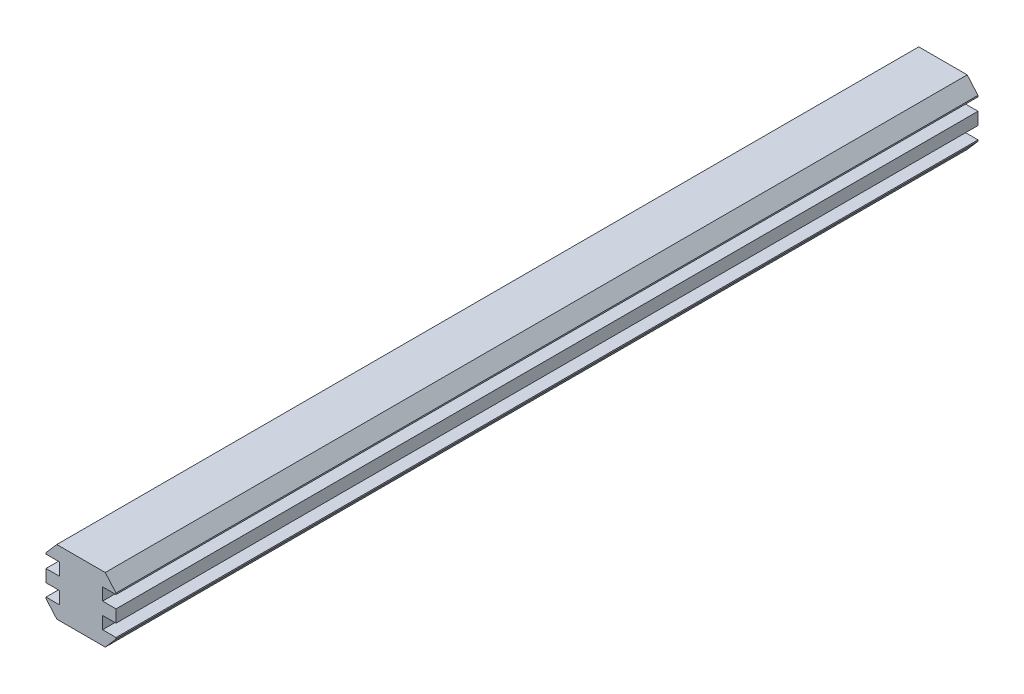
ISO-10303-21;
HEADER;
FILE_DESCRIPTION(('STEP AP214'),'2;1');
FILE_NAME('part.step','',(''),(''),'','','');
FILE_SCHEMA(('AUTOMOTIVE_DESIGN { 1 0 10303 214 1 1 1 1 }'));
ENDSEC;
DATA;
#1=APPLICATION_CONTEXT('core data for automotive mechanical design processes');
#2=APPLICATION_PROTOCOL_DEFINITION('international standard','automotive_design',2000,#1);
#3=PRODUCT_CONTEXT('',#1,'mechanical');
#4=PRODUCT('Part','Part','',(#3));
#5=PRODUCT_RELATED_PRODUCT_CATEGORY('part','',(#4));
#6=PRODUCT_DEFINITION_FORMATION('','',#4);
#7=PRODUCT_DEFINITION_CONTEXT('part definition',#1,'design');
#8=PRODUCT_DEFINITION('design','',#6,#7);
#9=PRODUCT_DEFINITION_SHAPE('','',#8);
#10=(LENGTH_UNIT() NAMED_UNIT(*) SI_UNIT(.MILLI.,.METRE.));
#11=(NAMED_UNIT(*) PLANE_ANGLE_UNIT() SI_UNIT($,.RADIAN.));
#12=(NAMED_UNIT(*) SI_UNIT($,.STERADIAN.) SOLID_ANGLE_UNIT());
#13=UNCERTAINTY_MEASURE_WITH_UNIT(LENGTH_MEASURE(1.E-05),#10,'distance_accuracy_value','');
#14=(GEOMETRIC_REPRESENTATION_CONTEXT(3) GLOBAL_UNCERTAINTY_ASSIGNED_CONTEXT((#13)) GLOBAL_UNIT_ASSIGNED_CONTEXT((#10,
#11,#12)) REPRESENTATION_CONTEXT('',''));
#15=CARTESIAN_POINT('',(0.,0.,0.));
#16=DIRECTION('',(0.,0.,1.));
#17=DIRECTION('',(1.,0.,0.));
#18=AXIS2_PLACEMENT_3D('',#15,#16,#17);
#19=CARTESIAN_POINT('',(4.,3.45,160.));
#20=DIRECTION('',(-1.,0.,0.));
#21=DIRECTION('',(0.,-1.,0.));
#22=AXIS2_PLACEMENT_3D('',#19,#20,#21);
#23=PLANE('',#22);
#24=DIRECTION('',(0.,1.,0.));
#25=VECTOR('',#24,1.);
#26=CARTESIAN_POINT('',(4.,3.45,0.));
#27=LINE('',#26,#25);
#28=CARTESIAN_POINT('',(4.,1.15,0.));
#29=VERTEX_POINT('',#28);
#30=CARTESIAN_POINT('',(4.,3.45,0.));
#31=VERTEX_POINT('',#30);
#32=EDGE_CURVE('E225',#29,#31,#27,.T.);
#33=ORIENTED_EDGE('',*,*,#32,.T.);
#34=DIRECTION('',(0.,0.,-1.));
#35=VECTOR('',#34,1.);
#36=CARTESIAN_POINT('',(4.,3.45,160.));
#37=LINE('',#36,#35);
#38=CARTESIAN_POINT('',(4.,3.45,160.));
#39=VERTEX_POINT('',#38);
#40=EDGE_CURVE('E11',#39,#31,#37,.T.);
#41=ORIENTED_EDGE('',*,*,#40,.F.);
#42=DIRECTION('',(0.,1.,0.));
#43=VECTOR('',#42,1.);
#44=CARTESIAN_POINT('',(4.,3.45,160.));
#45=LINE('',#44,#43);
#46=CARTESIAN_POINT('',(4.,1.15,160.));
#47=VERTEX_POINT('',#46);
#48=EDGE_CURVE('E271',#47,#39,#45,.T.);
#49=ORIENTED_EDGE('',*,*,#48,.F.);
#50=DIRECTION('',(0.,0.,-1.));
#51=VECTOR('',#50,1.);
#52=CARTESIAN_POINT('',(4.,1.15,160.));
#53=LINE('',#52,#51);
#54=EDGE_CURVE('E221',#47,#29,#53,.T.);
#55=ORIENTED_EDGE('',*,*,#54,.T.);
#56=EDGE_LOOP('',(#33,#41,#49,#55));
#57=FACE_BOUND('',#56,.T.);
#58=ADVANCED_FACE('F33',(#57),#23,.F.);
#59=CARTESIAN_POINT('',(6.5,3.45,160.));
#60=DIRECTION('',(0.,1.,0.));
#61=DIRECTION('',(-1.,0.,0.));
#62=AXIS2_PLACEMENT_3D('',#59,#60,#61);
#63=PLANE('',#62);
#64=DIRECTION('',(1.,0.,0.));
#65=VECTOR('',#64,1.);
#66=CARTESIAN_POINT('',(6.5,3.45,0.));
#67=LINE('',#66,#65);
#68=CARTESIAN_POINT('',(6.5,3.45,0.));
#69=VERTEX_POINT('',#68);
#70=EDGE_CURVE('E228',#31,#69,#67,.T.);
#71=ORIENTED_EDGE('',*,*,#70,.T.);
#72=DIRECTION('',(0.,0.,-1.));
#73=VECTOR('',#72,1.);
#74=CARTESIAN_POINT('',(6.5,3.45,160.));
#75=LINE('',#74,#73);
#76=CARTESIAN_POINT('',(6.5,3.45,160.));
#77=VERTEX_POINT('',#76);
#78=EDGE_CURVE('E41',#77,#69,#75,.T.);
#79=ORIENTED_EDGE('',*,*,#78,.F.);
#80=DIRECTION('',(1.,0.,0.));
#81=VECTOR('',#80,1.);
#82=CARTESIAN_POINT('',(6.5,3.45,160.));
#83=LINE('',#82,#81);
#84=EDGE_CURVE('E140',#39,#77,#83,.T.);
#85=ORIENTED_EDGE('',*,*,#84,.F.);
#86=ORIENTED_EDGE('',*,*,#40,.T.);
#87=EDGE_LOOP('',(#71,#79,#85,#86));
#88=FACE_BOUND('',#87,.T.);
#89=ADVANCED_FACE('F409',(#88),#63,.F.);
#90=CARTESIAN_POINT('',(6.5,3.7,160.));
#91=DIRECTION('',(-1.,0.,0.));
#92=DIRECTION('',(0.,-1.,0.));
#93=AXIS2_PLACEMENT_3D('',#90,#91,#92);
#94=PLANE('',#93);
#95=DIRECTION('',(0.,1.,0.));
#96=VECTOR('',#95,1.);
#97=CARTESIAN_POINT('',(6.5,3.7,0.));
#98=LINE('',#97,#96);
#99=CARTESIAN_POINT('',(6.5,3.7,0.));
#100=VERTEX_POINT('',#99);
#101=EDGE_CURVE('E230',#69,#100,#98,.T.);
#102=ORIENTED_EDGE('',*,*,#101,.T.);
#103=DIRECTION('',(0.,0.,-1.));
#104=VECTOR('',#103,1.);
#105=CARTESIAN_POINT('',(6.5,3.7,160.));
#106=LINE('',#105,#104);
#107=CARTESIAN_POINT('',(6.5,3.7,160.));
#108=VERTEX_POINT('',#107);
#109=EDGE_CURVE('E326',#108,#100,#106,.T.);
#110=ORIENTED_EDGE('',*,*,#109,.F.);
#111=DIRECTION('',(0.,1.,0.));
#112=VECTOR('',#111,1.);
#113=CARTESIAN_POINT('',(6.5,3.7,160.));
#114=LINE('',#113,#112);
#115=EDGE_CURVE('E334',#77,#108,#114,.T.);
#116=ORIENTED_EDGE('',*,*,#115,.F.);
#117=ORIENTED_EDGE('',*,*,#78,.T.);
#118=EDGE_LOOP('',(#102,#110,#116,#117));
#119=FACE_BOUND('',#118,.T.);
#120=ADVANCED_FACE('F332',(#119),#94,.F.);
#121=CARTESIAN_POINT('',(4.5,6.,160.));
#122=DIRECTION('',(-0.754605522163505,-0.656178714924786,0.));
#123=DIRECTION('',(0.656178714924786,-0.754605522163505,0.));
#124=AXIS2_PLACEMENT_3D('',#121,#122,#123);
#125=PLANE('',#124);
#126=DIRECTION('',(-0.656178714924786,0.754605522163505,0.));
#127=VECTOR('',#126,1.);
#128=CARTESIAN_POINT('',(4.5,6.,0.));
#129=LINE('',#128,#127);
#130=CARTESIAN_POINT('',(4.5,6.,0.));
#131=VERTEX_POINT('',#130);
#132=EDGE_CURVE('E232',#100,#131,#129,.T.);
#133=ORIENTED_EDGE('',*,*,#132,.T.);
#134=DIRECTION('',(0.,0.,-1.));
#135=VECTOR('',#134,1.);
#136=CARTESIAN_POINT('',(4.5,6.,160.));
#137=LINE('',#136,#135);
#138=CARTESIAN_POINT('',(4.5,6.,160.));
#139=VERTEX_POINT('',#138);
#140=EDGE_CURVE('E323',#139,#131,#137,.T.);
#141=ORIENTED_EDGE('',*,*,#140,.F.);
#142=DIRECTION('',(-0.656178714924786,0.754605522163505,0.));
#143=VECTOR('',#142,1.);
#144=CARTESIAN_POINT('',(4.5,6.,160.));
#145=LINE('',#144,#143);
#146=EDGE_CURVE('E352',#108,#139,#145,.T.);
#147=ORIENTED_EDGE('',*,*,#146,.F.);
#148=ORIENTED_EDGE('',*,*,#109,.T.);
#149=EDGE_LOOP('',(#133,#141,#147,#148));
#150=FACE_BOUND('',#149,.T.);
#151=ADVANCED_FACE('F343',(#150),#125,.F.);
#152=CARTESIAN_POINT('',(-4.5,6.,160.));
#153=DIRECTION('',(0.,-1.,0.));
#154=DIRECTION('',(1.,0.,0.));
#155=AXIS2_PLACEMENT_3D('',#152,#153,#154);
#156=PLANE('',#155);
#157=DIRECTION('',(-1.,0.,0.));
#158=VECTOR('',#157,1.);
#159=CARTESIAN_POINT('',(-4.5,6.,0.));
#160=LINE('',#159,#158);
#161=CARTESIAN_POINT('',(-4.5,6.,0.));
#162=VERTEX_POINT('',#161);
#163=EDGE_CURVE('E234',#131,#162,#160,.T.);
#164=ORIENTED_EDGE('',*,*,#163,.T.);
#165=DIRECTION('',(0.,0.,-1.));
#166=VECTOR('',#165,1.);
#167=CARTESIAN_POINT('',(-4.5,6.,160.));
#168=LINE('',#167,#166);
#169=CARTESIAN_POINT('',(-4.5,6.,160.));
#170=VERTEX_POINT('',#169);
#171=EDGE_CURVE('E320',#170,#162,#168,.T.);
#172=ORIENTED_EDGE('',*,*,#171,.F.);
#173=DIRECTION('',(-1.,0.,0.));
#174=VECTOR('',#173,1.);
#175=CARTESIAN_POINT('',(-4.5,6.,160.));
#176=LINE('',#175,#174);
#177=EDGE_CURVE('E349',#139,#170,#176,.T.);
#178=ORIENTED_EDGE('',*,*,#177,.F.);
#179=ORIENTED_EDGE('',*,*,#140,.T.);
#180=EDGE_LOOP('',(#164,#172,#178,#179));
#181=FACE_BOUND('',#180,.T.);
#182=ADVANCED_FACE('F347',(#181),#156,.F.);
#183=CARTESIAN_POINT('',(-4.5,6.,160.));
#184=DIRECTION('',(0.754605522163505,-0.656178714924786,0.));
#185=DIRECTION('',(0.656178714924786,0.754605522163505,0.));
#186=AXIS2_PLACEMENT_3D('',#183,#184,#185);
#187=PLANE('',#186);
#188=DIRECTION('',(-0.656178714924786,-0.754605522163505,0.));
#189=VECTOR('',#188,1.);
#190=CARTESIAN_POINT('',(-4.5,6.,0.));
#191=LINE('',#190,#189);
#192=CARTESIAN_POINT('',(-6.49999999999999,3.7,0.));
#193=VERTEX_POINT('',#192);
#194=EDGE_CURVE('E236',#162,#193,#191,.T.);
#195=ORIENTED_EDGE('',*,*,#194,.T.);
#196=DIRECTION('',(0.,0.,-1.));
#197=VECTOR('',#196,1.);
#198=CARTESIAN_POINT('',(-6.49999999999999,3.7,160.));
#199=LINE('',#198,#197);
#200=CARTESIAN_POINT('',(-6.49999999999999,3.7,160.));
#201=VERTEX_POINT('',#200);
#202=EDGE_CURVE('E317',#201,#193,#199,.T.);
#203=ORIENTED_EDGE('',*,*,#202,.F.);
#204=DIRECTION('',(-0.656178714924786,-0.754605522163505,0.));
#205=VECTOR('',#204,1.);
#206=CARTESIAN_POINT('',(-4.5,6.,160.));
#207=LINE('',#206,#205);
#208=EDGE_CURVE('E351',#170,#201,#207,.T.);
#209=ORIENTED_EDGE('',*,*,#208,.F.);
#210=ORIENTED_EDGE('',*,*,#171,.T.);
#211=EDGE_LOOP('',(#195,#203,#209,#210));
#212=FACE_BOUND('',#211,.T.);
#213=ADVANCED_FACE('F422',(#212),#187,.F.);
#214=CARTESIAN_POINT('',(-6.49999999999999,3.7,160.));
#215=DIRECTION('',(1.,0.,0.));
#216=DIRECTION('',(0.,1.,0.));
#217=AXIS2_PLACEMENT_3D('',#214,#215,#216);
#218=PLANE('',#217);
#219=DIRECTION('',(0.,-1.,0.));
#220=VECTOR('',#219,1.);
#221=CARTESIAN_POINT('',(-6.49999999999999,3.7,0.));
#222=LINE('',#221,#220);
#223=CARTESIAN_POINT('',(-6.5,3.45,0.));
#224=VERTEX_POINT('',#223);
#225=EDGE_CURVE('E238',#193,#224,#222,.T.);
#226=ORIENTED_EDGE('',*,*,#225,.T.);
#227=DIRECTION('',(0.,0.,-1.));
#228=VECTOR('',#227,1.);
#229=CARTESIAN_POINT('',(-6.5,3.45,160.));
#230=LINE('',#229,#228);
#231=CARTESIAN_POINT('',(-6.5,3.45,160.));
#232=VERTEX_POINT('',#231);
#233=EDGE_CURVE('E314',#232,#224,#230,.T.);
#234=ORIENTED_EDGE('',*,*,#233,.F.);
#235=DIRECTION('',(0.,-1.,0.));
#236=VECTOR('',#235,1.);
#237=CARTESIAN_POINT('',(-6.49999999999999,3.7,160.));
#238=LINE('',#237,#236);
#239=EDGE_CURVE('E354',#201,#232,#238,.T.);
#240=ORIENTED_EDGE('',*,*,#239,.F.);
#241=ORIENTED_EDGE('',*,*,#202,.T.);
#242=EDGE_LOOP('',(#226,#234,#240,#241));
#243=FACE_BOUND('',#242,.T.);
#244=ADVANCED_FACE('F425',(#243),#218,.F.);
#245=CARTESIAN_POINT('',(-6.5,3.45,160.));
#246=DIRECTION('',(0.,1.,0.));
#247=DIRECTION('',(-1.,0.,0.));
#248=AXIS2_PLACEMENT_3D('',#245,#246,#247);
#249=PLANE('',#248);
#250=DIRECTION('',(1.,0.,0.));
#251=VECTOR('',#250,1.);
#252=CARTESIAN_POINT('',(-6.5,3.45,0.));
#253=LINE('',#252,#251);
#254=CARTESIAN_POINT('',(-4.,3.45,0.));
#255=VERTEX_POINT('',#254);
#256=EDGE_CURVE('E240',#224,#255,#253,.T.);
#257=ORIENTED_EDGE('',*,*,#256,.T.);
#258=DIRECTION('',(0.,0.,-1.));
#259=VECTOR('',#258,1.);
#260=CARTESIAN_POINT('',(-4.,3.45,160.));
#261=LINE('',#260,#259);
#262=CARTESIAN_POINT('',(-4.,3.45,160.));
#263=VERTEX_POINT('',#262);
#264=EDGE_CURVE('E311',#263,#255,#261,.T.);
#265=ORIENTED_EDGE('',*,*,#264,.F.);
#266=DIRECTION('',(1.,0.,0.));
#267=VECTOR('',#266,1.);
#268=CARTESIAN_POINT('',(-6.5,3.45,160.));
#269=LINE('',#268,#267);
#270=EDGE_CURVE('E360',#232,#263,#269,.T.);
#271=ORIENTED_EDGE('',*,*,#270,.F.);
#272=ORIENTED_EDGE('',*,*,#233,.T.);
#273=EDGE_LOOP('',(#257,#265,#271,#272));
#274=FACE_BOUND('',#273,.T.);
#275=ADVANCED_FACE('F429',(#274),#249,.F.);
#276=CARTESIAN_POINT('',(-4.,3.45,160.));
#277=DIRECTION('',(1.,0.,0.));
#278=DIRECTION('',(0.,1.,0.));
#279=AXIS2_PLACEMENT_3D('',#276,#277,#278);
#280=PLANE('',#279);
#281=DIRECTION('',(0.,-1.,0.));
#282=VECTOR('',#281,1.);
#283=CARTESIAN_POINT('',(-4.,3.45,0.));
#284=LINE('',#283,#282);
#285=CARTESIAN_POINT('',(-4.,1.15,0.));
#286=VERTEX_POINT('',#285);
#287=EDGE_CURVE('E242',#255,#286,#284,.T.);
#288=ORIENTED_EDGE('',*,*,#287,.T.);
#289=DIRECTION('',(0.,0.,-1.));
#290=VECTOR('',#289,1.);
#291=CARTESIAN_POINT('',(-4.,1.15,160.));
#292=LINE('',#291,#290);
#293=CARTESIAN_POINT('',(-4.,1.15,160.));
#294=VERTEX_POINT('',#293);
#295=EDGE_CURVE('E308',#294,#286,#292,.T.);
#296=ORIENTED_EDGE('',*,*,#295,.F.);
#297=DIRECTION('',(0.,-1.,0.));
#298=VECTOR('',#297,1.);
#299=CARTESIAN_POINT('',(-4.,3.45,160.));
#300=LINE('',#299,#298);
#301=EDGE_CURVE('E362',#263,#294,#300,.T.);
#302=ORIENTED_EDGE('',*,*,#301,.F.);
#303=ORIENTED_EDGE('',*,*,#264,.T.);
#304=EDGE_LOOP('',(#288,#296,#302,#303));
#305=FACE_BOUND('',#304,.T.);
#306=ADVANCED_FACE('F433',(#305),#280,.F.);
#307=CARTESIAN_POINT('',(-4.,1.15,160.));
#308=DIRECTION('',(0.,-1.,0.));
#309=DIRECTION('',(1.,0.,0.));
#310=AXIS2_PLACEMENT_3D('',#307,#308,#309);
#311=PLANE('',#310);
#312=DIRECTION('',(-1.,0.,0.));
#313=VECTOR('',#312,1.);
#314=CARTESIAN_POINT('',(-4.,1.15,0.));
#315=LINE('',#314,#313);
#316=CARTESIAN_POINT('',(-6.5,1.15,0.));
#317=VERTEX_POINT('',#316);
#318=EDGE_CURVE('E244',#286,#317,#315,.T.);
#319=ORIENTED_EDGE('',*,*,#318,.T.);
#320=DIRECTION('',(0.,0.,-1.));
#321=VECTOR('',#320,1.);
#322=CARTESIAN_POINT('',(-6.5,1.15,160.));
#323=LINE('',#322,#321);
#324=CARTESIAN_POINT('',(-6.5,1.15,160.));
#325=VERTEX_POINT('',#324);
#326=EDGE_CURVE('E305',#325,#317,#323,.T.);
#327=ORIENTED_EDGE('',*,*,#326,.F.);
#328=DIRECTION('',(-1.,0.,0.));
#329=VECTOR('',#328,1.);
#330=CARTESIAN_POINT('',(-4.,1.15,160.));
#331=LINE('',#330,#329);
#332=EDGE_CURVE('E364',#294,#325,#331,.T.);
#333=ORIENTED_EDGE('',*,*,#332,.F.);
#334=ORIENTED_EDGE('',*,*,#295,.T.);
#335=EDGE_LOOP('',(#319,#327,#333,#334));
#336=FACE_BOUND('',#335,.T.);
#337=ADVANCED_FACE('F437',(#336),#311,.F.);
#338=CARTESIAN_POINT('',(-6.5,-1.15,160.));
#339=DIRECTION('',(1.,0.,0.));
#340=DIRECTION('',(0.,0.,-1.));
#341=AXIS2_PLACEMENT_3D('',#338,#339,#340);
#342=PLANE('',#341);
#343=DIRECTION('',(0.,-1.,0.));
#344=VECTOR('',#343,1.);
#345=CARTESIAN_POINT('',(-6.5,-1.15,0.));
#346=LINE('',#345,#344);
#347=CARTESIAN_POINT('',(-6.5,-1.15,0.));
#348=VERTEX_POINT('',#347);
#349=EDGE_CURVE('E246',#317,#348,#346,.T.);
#350=ORIENTED_EDGE('',*,*,#349,.T.);
#351=DIRECTION('',(0.,0.,-1.));
#352=VECTOR('',#351,1.);
#353=CARTESIAN_POINT('',(-6.5,-1.15,160.));
#354=LINE('',#353,#352);
#355=CARTESIAN_POINT('',(-6.5,-1.15,160.));
#356=VERTEX_POINT('',#355);
#357=EDGE_CURVE('E302',#356,#348,#354,.T.);
#358=ORIENTED_EDGE('',*,*,#357,.F.);
#359=DIRECTION('',(0.,-1.,0.));
#360=VECTOR('',#359,1.);
#361=CARTESIAN_POINT('',(-6.5,-1.15,160.));
#362=LINE('',#361,#360);
#363=EDGE_CURVE('E366',#325,#356,#362,.T.);
#364=ORIENTED_EDGE('',*,*,#363,.F.);
#365=ORIENTED_EDGE('',*,*,#326,.T.);
#366=EDGE_LOOP('',(#350,#358,#364,#365));
#367=FACE_BOUND('',#366,.T.);
#368=ADVANCED_FACE('F441',(#367),#342,.F.);
#369=CARTESIAN_POINT('',(-4.,-1.15,160.));
#370=DIRECTION('',(0.,1.,0.));
#371=DIRECTION('',(-1.,0.,0.));
#372=AXIS2_PLACEMENT_3D('',#369,#370,#371);
#373=PLANE('',#372);
#374=DIRECTION('',(1.,0.,0.));
#375=VECTOR('',#374,1.);
#376=CARTESIAN_POINT('',(-4.,-1.15,0.));
#377=LINE('',#376,#375);
#378=CARTESIAN_POINT('',(-4.,-1.15,0.));
#379=VERTEX_POINT('',#378);
#380=EDGE_CURVE('E248',#348,#379,#377,.T.);
#381=ORIENTED_EDGE('',*,*,#380,.T.);
#382=DIRECTION('',(0.,0.,-1.));
#383=VECTOR('',#382,1.);
#384=CARTESIAN_POINT('',(-4.,-1.15,160.));
#385=LINE('',#384,#383);
#386=CARTESIAN_POINT('',(-4.,-1.15,160.));
#387=VERTEX_POINT('',#386);
#388=EDGE_CURVE('E299',#387,#379,#385,.T.);
#389=ORIENTED_EDGE('',*,*,#388,.F.);
#390=DIRECTION('',(1.,0.,0.));
#391=VECTOR('',#390,1.);
#392=CARTESIAN_POINT('',(-4.,-1.15,160.));
#393=LINE('',#392,#391);
#394=EDGE_CURVE('E368',#356,#387,#393,.T.);
#395=ORIENTED_EDGE('',*,*,#394,.F.);
#396=ORIENTED_EDGE('',*,*,#357,.T.);
#397=EDGE_LOOP('',(#381,#389,#395,#396));
#398=FACE_BOUND('',#397,.T.);
#399=ADVANCED_FACE('F445',(#398),#373,.F.);
#400=CARTESIAN_POINT('',(-4.,-3.45,160.));
#401=DIRECTION('',(1.,0.,0.));
#402=DIRECTION('',(0.,1.,0.));
#403=AXIS2_PLACEMENT_3D('',#400,#401,#402);
#404=PLANE('',#403);
#405=DIRECTION('',(0.,-1.,0.));
#406=VECTOR('',#405,1.);
#407=CARTESIAN_POINT('',(-4.,-3.45,0.));
#408=LINE('',#407,#406);
#409=CARTESIAN_POINT('',(-4.,-3.45,0.));
#410=VERTEX_POINT('',#409);
#411=EDGE_CURVE('E250',#379,#410,#408,.T.);
#412=ORIENTED_EDGE('',*,*,#411,.T.);
#413=DIRECTION('',(0.,0.,-1.));
#414=VECTOR('',#413,1.);
#415=CARTESIAN_POINT('',(-4.,-3.45,160.));
#416=LINE('',#415,#414);
#417=CARTESIAN_POINT('',(-4.,-3.45,160.));
#418=VERTEX_POINT('',#417);
#419=EDGE_CURVE('E296',#418,#410,#416,.T.);
#420=ORIENTED_EDGE('',*,*,#419,.F.);
#421=DIRECTION('',(0.,-1.,0.));
#422=VECTOR('',#421,1.);
#423=CARTESIAN_POINT('',(-4.,-3.45,160.));
#424=LINE('',#423,#422);
#425=EDGE_CURVE('E370',#387,#418,#424,.T.);
#426=ORIENTED_EDGE('',*,*,#425,.F.);
#427=ORIENTED_EDGE('',*,*,#388,.T.);
#428=EDGE_LOOP('',(#412,#420,#426,#427));
#429=FACE_BOUND('',#428,.T.);
#430=ADVANCED_FACE('F449',(#429),#404,.F.);
#431=CARTESIAN_POINT('',(-6.49999999999999,-3.45,160.));
#432=DIRECTION('',(0.,-1.,0.));
#433=DIRECTION('',(1.,0.,0.));
#434=AXIS2_PLACEMENT_3D('',#431,#432,#433);
#435=PLANE('',#434);
#436=DIRECTION('',(-1.,0.,0.));
#437=VECTOR('',#436,1.);
#438=CARTESIAN_POINT('',(-6.49999999999999,-3.45,0.));
#439=LINE('',#438,#437);
#440=CARTESIAN_POINT('',(-6.49999999999999,-3.45,0.));
#441=VERTEX_POINT('',#440);
#442=EDGE_CURVE('E252',#410,#441,#439,.T.);
#443=ORIENTED_EDGE('',*,*,#442,.T.);
#444=DIRECTION('',(0.,0.,-1.));
#445=VECTOR('',#444,1.);
#446=CARTESIAN_POINT('',(-6.49999999999999,-3.45,160.));
#447=LINE('',#446,#445);
#448=CARTESIAN_POINT('',(-6.49999999999999,-3.45,160.));
#449=VERTEX_POINT('',#448);
#450=EDGE_CURVE('E293',#449,#441,#447,.T.);
#451=ORIENTED_EDGE('',*,*,#450,.F.);
#452=DIRECTION('',(-1.,0.,0.));
#453=VECTOR('',#452,1.);
#454=CARTESIAN_POINT('',(-6.49999999999999,-3.45,160.));
#455=LINE('',#454,#453);
#456=EDGE_CURVE('E372',#418,#449,#455,.T.);
#457=ORIENTED_EDGE('',*,*,#456,.F.);
#458=ORIENTED_EDGE('',*,*,#419,.T.);
#459=EDGE_LOOP('',(#443,#451,#457,#458));
#460=FACE_BOUND('',#459,.T.);
#461=ADVANCED_FACE('F453',(#460),#435,.F.);
#462=CARTESIAN_POINT('',(-6.49999999999999,-3.7,160.));
#463=DIRECTION('',(1.,0.,0.));
#464=DIRECTION('',(0.,0.,-1.));
#465=AXIS2_PLACEMENT_3D('',#462,#463,#464);
#466=PLANE('',#465);
#467=DIRECTION('',(0.,-1.,0.));
#468=VECTOR('',#467,1.);
#469=CARTESIAN_POINT('',(-6.49999999999999,-3.7,0.));
#470=LINE('',#469,#468);
#471=CARTESIAN_POINT('',(-6.49999999999999,-3.7,0.));
#472=VERTEX_POINT('',#471);
#473=EDGE_CURVE('E254',#441,#472,#470,.T.);
#474=ORIENTED_EDGE('',*,*,#473,.T.);
#475=DIRECTION('',(0.,0.,-1.));
#476=VECTOR('',#475,1.);
#477=CARTESIAN_POINT('',(-6.49999999999999,-3.7,160.));
#478=LINE('',#477,#476);
#479=CARTESIAN_POINT('',(-6.49999999999999,-3.7,160.));
#480=VERTEX_POINT('',#479);
#481=EDGE_CURVE('E290',#480,#472,#478,.T.);
#482=ORIENTED_EDGE('',*,*,#481,.F.);
#483=DIRECTION('',(0.,-1.,0.));
#484=VECTOR('',#483,1.);
#485=CARTESIAN_POINT('',(-6.49999999999999,-3.7,160.));
#486=LINE('',#485,#484);
#487=EDGE_CURVE('E374',#449,#480,#486,.T.);
#488=ORIENTED_EDGE('',*,*,#487,.F.);
#489=ORIENTED_EDGE('',*,*,#450,.T.);
#490=EDGE_LOOP('',(#474,#482,#488,#489));
#491=FACE_BOUND('',#490,.T.);
#492=ADVANCED_FACE('F457',(#491),#466,.F.);
#493=CARTESIAN_POINT('',(-4.5,-6.,160.));
#494=DIRECTION('',(0.754605522163505,0.656178714924786,0.));
#495=DIRECTION('',(-0.656178714924786,0.754605522163505,0.));
#496=AXIS2_PLACEMENT_3D('',#493,#494,#495);
#497=PLANE('',#496);
#498=DIRECTION('',(0.656178714924786,-0.754605522163505,0.));
#499=VECTOR('',#498,1.);
#500=CARTESIAN_POINT('',(-4.5,-6.,0.));
#501=LINE('',#500,#499);
#502=CARTESIAN_POINT('',(-4.5,-6.,0.));
#503=VERTEX_POINT('',#502);
#504=EDGE_CURVE('E256',#472,#503,#501,.T.);
#505=ORIENTED_EDGE('',*,*,#504,.T.);
#506=DIRECTION('',(0.,0.,-1.));
#507=VECTOR('',#506,1.);
#508=CARTESIAN_POINT('',(-4.5,-6.,160.));
#509=LINE('',#508,#507);
#510=CARTESIAN_POINT('',(-4.5,-6.,160.));
#511=VERTEX_POINT('',#510);
#512=EDGE_CURVE('E287',#511,#503,#509,.T.);
#513=ORIENTED_EDGE('',*,*,#512,.F.);
#514=DIRECTION('',(0.656178714924786,-0.754605522163505,0.));
#515=VECTOR('',#514,1.);
#516=CARTESIAN_POINT('',(-4.5,-6.,160.));
#517=LINE('',#516,#515);
#518=EDGE_CURVE('E376',#480,#511,#517,.T.);
#519=ORIENTED_EDGE('',*,*,#518,.F.);
#520=ORIENTED_EDGE('',*,*,#481,.T.);
#521=EDGE_LOOP('',(#505,#513,#519,#520));
#522=FACE_BOUND('',#521,.T.);
#523=ADVANCED_FACE('F461',(#522),#497,.F.);
#524=CARTESIAN_POINT('',(-4.5,-6.,160.));
#525=DIRECTION('',(0.,1.,0.));
#526=DIRECTION('',(-1.,0.,0.));
#527=AXIS2_PLACEMENT_3D('',#524,#525,#526);
#528=PLANE('',#527);
#529=DIRECTION('',(1.,0.,0.));
#530=VECTOR('',#529,1.);
#531=CARTESIAN_POINT('',(-4.5,-6.,0.));
#532=LINE('',#531,#530);
#533=CARTESIAN_POINT('',(4.5,-6.,0.));
#534=VERTEX_POINT('',#533);
#535=EDGE_CURVE('E258',#503,#534,#532,.T.);
#536=ORIENTED_EDGE('',*,*,#535,.T.);
#537=DIRECTION('',(0.,0.,-1.));
#538=VECTOR('',#537,1.);
#539=CARTESIAN_POINT('',(4.5,-6.,160.));
#540=LINE('',#539,#538);
#541=CARTESIAN_POINT('',(4.5,-6.,160.));
#542=VERTEX_POINT('',#541);
#543=EDGE_CURVE('E284',#542,#534,#540,.T.);
#544=ORIENTED_EDGE('',*,*,#543,.F.);
#545=DIRECTION('',(1.,0.,0.));
#546=VECTOR('',#545,1.);
#547=CARTESIAN_POINT('',(-4.5,-6.,160.));
#548=LINE('',#547,#546);
#549=EDGE_CURVE('E378',#511,#542,#548,.T.);
#550=ORIENTED_EDGE('',*,*,#549,.F.);
#551=ORIENTED_EDGE('',*,*,#512,.T.);
#552=EDGE_LOOP('',(#536,#544,#550,#551));
#553=FACE_BOUND('',#552,.T.);
#554=ADVANCED_FACE('F465',(#553),#528,.F.);
#555=CARTESIAN_POINT('',(4.5,-6.,160.));
#556=DIRECTION('',(-0.754605522163505,0.656178714924786,0.));
#557=DIRECTION('',(-0.656178714924786,-0.754605522163505,0.));
#558=AXIS2_PLACEMENT_3D('',#555,#556,#557);
#559=PLANE('',#558);
#560=DIRECTION('',(0.656178714924786,0.754605522163505,0.));
#561=VECTOR('',#560,1.);
#562=CARTESIAN_POINT('',(4.5,-6.,0.));
#563=LINE('',#562,#561);
#564=CARTESIAN_POINT('',(6.5,-3.7,0.));
#565=VERTEX_POINT('',#564);
#566=EDGE_CURVE('E260',#534,#565,#563,.T.);
#567=ORIENTED_EDGE('',*,*,#566,.T.);
#568=DIRECTION('',(0.,0.,-1.));
#569=VECTOR('',#568,1.);
#570=CARTESIAN_POINT('',(6.5,-3.7,160.));
#571=LINE('',#570,#569);
#572=CARTESIAN_POINT('',(6.5,-3.7,160.));
#573=VERTEX_POINT('',#572);
#574=EDGE_CURVE('E281',#573,#565,#571,.T.);
#575=ORIENTED_EDGE('',*,*,#574,.F.);
#576=DIRECTION('',(0.656178714924786,0.754605522163505,0.));
#577=VECTOR('',#576,1.);
#578=CARTESIAN_POINT('',(4.5,-6.,160.));
#579=LINE('',#578,#577);
#580=EDGE_CURVE('E380',#542,#573,#579,.T.);
#581=ORIENTED_EDGE('',*,*,#580,.F.);
#582=ORIENTED_EDGE('',*,*,#543,.T.);
#583=EDGE_LOOP('',(#567,#575,#581,#582));
#584=FACE_BOUND('',#583,.T.);
#585=ADVANCED_FACE('F469',(#584),#559,.F.);
#586=CARTESIAN_POINT('',(6.5,-3.7,160.));
#587=DIRECTION('',(-1.,0.,0.));
#588=DIRECTION('',(0.,-1.,0.));
#589=AXIS2_PLACEMENT_3D('',#586,#587,#588);
#590=PLANE('',#589);
#591=DIRECTION('',(0.,1.,0.));
#592=VECTOR('',#591,1.);
#593=CARTESIAN_POINT('',(6.5,-3.7,0.));
#594=LINE('',#593,#592);
#595=CARTESIAN_POINT('',(6.5,-3.45,0.));
#596=VERTEX_POINT('',#595);
#597=EDGE_CURVE('E262',#565,#596,#594,.T.);
#598=ORIENTED_EDGE('',*,*,#597,.T.);
#599=DIRECTION('',(0.,0.,-1.));
#600=VECTOR('',#599,1.);
#601=CARTESIAN_POINT('',(6.5,-3.45,160.));
#602=LINE('',#601,#600);
#603=CARTESIAN_POINT('',(6.5,-3.45,160.));
#604=VERTEX_POINT('',#603);
#605=EDGE_CURVE('E278',#604,#596,#602,.T.);
#606=ORIENTED_EDGE('',*,*,#605,.F.);
#607=DIRECTION('',(0.,1.,0.));
#608=VECTOR('',#607,1.);
#609=CARTESIAN_POINT('',(6.5,-3.7,160.));
#610=LINE('',#609,#608);
#611=EDGE_CURVE('E382',#573,#604,#610,.T.);
#612=ORIENTED_EDGE('',*,*,#611,.F.);
#613=ORIENTED_EDGE('',*,*,#574,.T.);
#614=EDGE_LOOP('',(#598,#606,#612,#613));
#615=FACE_BOUND('',#614,.T.);
#616=ADVANCED_FACE('F473',(#615),#590,.F.);
#617=CARTESIAN_POINT('',(6.5,-3.45,160.));
#618=DIRECTION('',(0.,-1.,0.));
#619=DIRECTION('',(1.,0.,0.));
#620=AXIS2_PLACEMENT_3D('',#617,#618,#619);
#621=PLANE('',#620);
#622=DIRECTION('',(-1.,0.,0.));
#623=VECTOR('',#622,1.);
#624=CARTESIAN_POINT('',(6.5,-3.45,0.));
#625=LINE('',#624,#623);
#626=CARTESIAN_POINT('',(4.,-3.45,0.));
#627=VERTEX_POINT('',#626);
#628=EDGE_CURVE('E264',#596,#627,#625,.T.);
#629=ORIENTED_EDGE('',*,*,#628,.T.);
#630=DIRECTION('',(0.,0.,-1.));
#631=VECTOR('',#630,1.);
#632=CARTESIAN_POINT('',(4.,-3.45,160.));
#633=LINE('',#632,#631);
#634=CARTESIAN_POINT('',(4.,-3.45,160.));
#635=VERTEX_POINT('',#634);
#636=EDGE_CURVE('E275',#635,#627,#633,.T.);
#637=ORIENTED_EDGE('',*,*,#636,.F.);
#638=DIRECTION('',(-1.,0.,0.));
#639=VECTOR('',#638,1.);
#640=CARTESIAN_POINT('',(6.5,-3.45,160.));
#641=LINE('',#640,#639);
#642=EDGE_CURVE('E384',#604,#635,#641,.T.);
#643=ORIENTED_EDGE('',*,*,#642,.F.);
#644=ORIENTED_EDGE('',*,*,#605,.T.);
#645=EDGE_LOOP('',(#629,#637,#643,#644));
#646=FACE_BOUND('',#645,.T.);
#647=ADVANCED_FACE('F390',(#646),#621,.F.);
#648=CARTESIAN_POINT('',(4.,-3.45,160.));
#649=DIRECTION('',(-1.,0.,0.));
#650=DIRECTION('',(0.,-1.,0.));
#651=AXIS2_PLACEMENT_3D('',#648,#649,#650);
#652=PLANE('',#651);
#653=DIRECTION('',(0.,1.,0.));
#654=VECTOR('',#653,1.);
#655=CARTESIAN_POINT('',(4.,-3.45,0.));
#656=LINE('',#655,#654);
#657=CARTESIAN_POINT('',(4.,-1.15,0.));
#658=VERTEX_POINT('',#657);
#659=EDGE_CURVE('E266',#627,#658,#656,.T.);
#660=ORIENTED_EDGE('',*,*,#659,.T.);
#661=DIRECTION('',(0.,0.,-1.));
#662=VECTOR('',#661,1.);
#663=CARTESIAN_POINT('',(4.,-1.15,160.));
#664=LINE('',#663,#662);
#665=CARTESIAN_POINT('',(4.,-1.15,160.));
#666=VERTEX_POINT('',#665);
#667=EDGE_CURVE('E216',#666,#658,#664,.T.);
#668=ORIENTED_EDGE('',*,*,#667,.F.);
#669=DIRECTION('',(0.,1.,0.));
#670=VECTOR('',#669,1.);
#671=CARTESIAN_POINT('',(4.,-3.45,160.));
#672=LINE('',#671,#670);
#673=EDGE_CURVE('E207',#635,#666,#672,.T.);
#674=ORIENTED_EDGE('',*,*,#673,.F.);
#675=ORIENTED_EDGE('',*,*,#636,.T.);
#676=EDGE_LOOP('',(#660,#668,#674,#675));
#677=FACE_BOUND('',#676,.T.);
#678=ADVANCED_FACE('F394',(#677),#652,.F.);
#679=CARTESIAN_POINT('',(4.,-1.15,160.));
#680=DIRECTION('',(0.,1.,0.));
#681=DIRECTION('',(-1.,0.,0.));
#682=AXIS2_PLACEMENT_3D('',#679,#680,#681);
#683=PLANE('',#682);
#684=DIRECTION('',(1.,0.,0.));
#685=VECTOR('',#684,1.);
#686=CARTESIAN_POINT('',(4.,-1.15,0.));
#687=LINE('',#686,#685);
#688=CARTESIAN_POINT('',(6.5,-1.15,0.));
#689=VERTEX_POINT('',#688);
#690=EDGE_CURVE('E215',#658,#689,#687,.T.);
#691=ORIENTED_EDGE('',*,*,#690,.T.);
#692=DIRECTION('',(0.,0.,-1.));
#693=VECTOR('',#692,1.);
#694=CARTESIAN_POINT('',(6.5,-1.15,160.));
#695=LINE('',#694,#693);
#696=CARTESIAN_POINT('',(6.5,-1.15,160.));
#697=VERTEX_POINT('',#696);
#698=EDGE_CURVE('E212',#697,#689,#695,.T.);
#699=ORIENTED_EDGE('',*,*,#698,.F.);
#700=DIRECTION('',(1.,0.,0.));
#701=VECTOR('',#700,1.);
#702=CARTESIAN_POINT('',(4.,-1.15,160.));
#703=LINE('',#702,#701);
#704=EDGE_CURVE('E201',#666,#697,#703,.T.);
#705=ORIENTED_EDGE('',*,*,#704,.F.);
#706=ORIENTED_EDGE('',*,*,#667,.T.);
#707=EDGE_LOOP('',(#691,#699,#705,#706));
#708=FACE_BOUND('',#707,.T.);
#709=ADVANCED_FACE('F213',(#708),#683,.F.);
#710=CARTESIAN_POINT('',(6.5,-1.15,160.));
#711=DIRECTION('',(-1.,0.,0.));
#712=DIRECTION('',(0.,0.,1.));
#713=AXIS2_PLACEMENT_3D('',#710,#711,#712);
#714=PLANE('',#713);
#715=DIRECTION('',(0.,1.,0.));
#716=VECTOR('',#715,1.);
#717=CARTESIAN_POINT('',(6.5,-1.15,0.));
#718=LINE('',#717,#716);
#719=CARTESIAN_POINT('',(6.5,1.15,0.));
#720=VERTEX_POINT('',#719);
#721=EDGE_CURVE('E126',#689,#720,#718,.T.);
#722=ORIENTED_EDGE('',*,*,#721,.T.);
#723=DIRECTION('',(0.,0.,-1.));
#724=VECTOR('',#723,1.);
#725=CARTESIAN_POINT('',(6.5,1.15,160.));
#726=LINE('',#725,#724);
#727=CARTESIAN_POINT('',(6.5,1.15,160.));
#728=VERTEX_POINT('',#727);
#729=EDGE_CURVE('E217',#728,#720,#726,.T.);
#730=ORIENTED_EDGE('',*,*,#729,.F.);
#731=DIRECTION('',(0.,1.,0.));
#732=VECTOR('',#731,1.);
#733=CARTESIAN_POINT('',(6.5,-1.15,160.));
#734=LINE('',#733,#732);
#735=EDGE_CURVE('E205',#697,#728,#734,.T.);
#736=ORIENTED_EDGE('',*,*,#735,.F.);
#737=ORIENTED_EDGE('',*,*,#698,.T.);
#738=EDGE_LOOP('',(#722,#730,#736,#737));
#739=FACE_BOUND('',#738,.T.);
#740=ADVANCED_FACE('F219',(#739),#714,.F.);
#741=CARTESIAN_POINT('',(4.,1.15,160.));
#742=DIRECTION('',(0.,-1.,0.));
#743=DIRECTION('',(1.,0.,0.));
#744=AXIS2_PLACEMENT_3D('',#741,#742,#743);
#745=PLANE('',#744);
#746=DIRECTION('',(-1.,0.,0.));
#747=VECTOR('',#746,1.);
#748=CARTESIAN_POINT('',(4.,1.15,0.));
#749=LINE('',#748,#747);
#750=EDGE_CURVE('E132',#720,#29,#749,.T.);
#751=ORIENTED_EDGE('',*,*,#750,.T.);
#752=ORIENTED_EDGE('',*,*,#54,.F.);
#753=DIRECTION('',(-1.,0.,0.));
#754=VECTOR('',#753,1.);
#755=CARTESIAN_POINT('',(4.,1.15,160.));
#756=LINE('',#755,#754);
#757=EDGE_CURVE('E49',#728,#47,#756,.T.);
#758=ORIENTED_EDGE('',*,*,#757,.F.);
#759=ORIENTED_EDGE('',*,*,#729,.T.);
#760=EDGE_LOOP('',(#751,#752,#758,#759));
#761=FACE_BOUND('',#760,.T.);
#762=ADVANCED_FACE('F398',(#761),#745,.F.);
#763=CARTESIAN_POINT('',(0.,0.,160.));
#764=DIRECTION('',(0.,0.,1.));
#765=DIRECTION('',(1.,0.,0.));
#766=AXIS2_PLACEMENT_3D('',#763,#764,#765);
#767=PLANE('',#766);
#768=ORIENTED_EDGE('',*,*,#48,.T.);
#769=ORIENTED_EDGE('',*,*,#84,.T.);
#770=ORIENTED_EDGE('',*,*,#115,.T.);
#771=ORIENTED_EDGE('',*,*,#146,.T.);
#772=ORIENTED_EDGE('',*,*,#177,.T.);
#773=ORIENTED_EDGE('',*,*,#208,.T.);
#774=ORIENTED_EDGE('',*,*,#239,.T.);
#775=ORIENTED_EDGE('',*,*,#270,.T.);
#776=ORIENTED_EDGE('',*,*,#301,.T.);
#777=ORIENTED_EDGE('',*,*,#332,.T.);
#778=ORIENTED_EDGE('',*,*,#363,.T.);
#779=ORIENTED_EDGE('',*,*,#394,.T.);
#780=ORIENTED_EDGE('',*,*,#425,.T.);
#781=ORIENTED_EDGE('',*,*,#456,.T.);
#782=ORIENTED_EDGE('',*,*,#487,.T.);
#783=ORIENTED_EDGE('',*,*,#518,.T.);
#784=ORIENTED_EDGE('',*,*,#549,.T.);
#785=ORIENTED_EDGE('',*,*,#580,.T.);
#786=ORIENTED_EDGE('',*,*,#611,.T.);
#787=ORIENTED_EDGE('',*,*,#642,.T.);
#788=ORIENTED_EDGE('',*,*,#673,.T.);
#789=ORIENTED_EDGE('',*,*,#704,.T.);
#790=ORIENTED_EDGE('',*,*,#735,.T.);
#791=ORIENTED_EDGE('',*,*,#757,.T.);
#792=EDGE_LOOP('',(#768,#769,#770,#771,#772,#773,#774,#775,#776,#777,#778,#779,#780,#781,#782,
#783,#784,#785,#786,#787,#788,#789,#790,#791));
#793=FACE_BOUND('',#792,.T.);
#794=ADVANCED_FACE('F203',(#793),#767,.T.);
#795=CARTESIAN_POINT('',(0.,0.,0.));
#796=DIRECTION('',(0.,0.,1.));
#797=DIRECTION('',(1.,0.,0.));
#798=AXIS2_PLACEMENT_3D('',#795,#796,#797);
#799=PLANE('',#798);
#800=ORIENTED_EDGE('',*,*,#32,.F.);
#801=ORIENTED_EDGE('',*,*,#750,.F.);
#802=ORIENTED_EDGE('',*,*,#721,.F.);
#803=ORIENTED_EDGE('',*,*,#690,.F.);
#804=ORIENTED_EDGE('',*,*,#659,.F.);
#805=ORIENTED_EDGE('',*,*,#628,.F.);
#806=ORIENTED_EDGE('',*,*,#597,.F.);
#807=ORIENTED_EDGE('',*,*,#566,.F.);
#808=ORIENTED_EDGE('',*,*,#535,.F.);
#809=ORIENTED_EDGE('',*,*,#504,.F.);
#810=ORIENTED_EDGE('',*,*,#473,.F.);
#811=ORIENTED_EDGE('',*,*,#442,.F.);
#812=ORIENTED_EDGE('',*,*,#411,.F.);
#813=ORIENTED_EDGE('',*,*,#380,.F.);
#814=ORIENTED_EDGE('',*,*,#349,.F.);
#815=ORIENTED_EDGE('',*,*,#318,.F.);
#816=ORIENTED_EDGE('',*,*,#287,.F.);
#817=ORIENTED_EDGE('',*,*,#256,.F.);
#818=ORIENTED_EDGE('',*,*,#225,.F.);
#819=ORIENTED_EDGE('',*,*,#194,.F.);
#820=ORIENTED_EDGE('',*,*,#163,.F.);
#821=ORIENTED_EDGE('',*,*,#132,.F.);
#822=ORIENTED_EDGE('',*,*,#101,.F.);
#823=ORIENTED_EDGE('',*,*,#70,.F.);
#824=EDGE_LOOP('',(#800,#801,#802,#803,#804,#805,#806,#807,#808,#809,#810,#811,#812,#813,#814,
#815,#816,#817,#818,#819,#820,#821,#822,#823));
#825=FACE_BOUND('',#824,.T.);
#826=ADVANCED_FACE('F338',(#825),#799,.F.);
#827=CLOSED_SHELL('',(#58,#89,#120,#151,#182,#213,#244,#275,#306,#337,#368,#399,#430,#461,#492,
#523,#554,#585,#616,#647,#678,#709,#740,#762,#794,#826));
#828=MANIFOLD_SOLID_BREP('B2',#827);
#829=ADVANCED_BREP_SHAPE_REPRESENTATION('',(#18,#828),#14);
#830=SHAPE_DEFINITION_REPRESENTATION(#9,#829);
ENDSEC;
END-ISO-10303-21;
